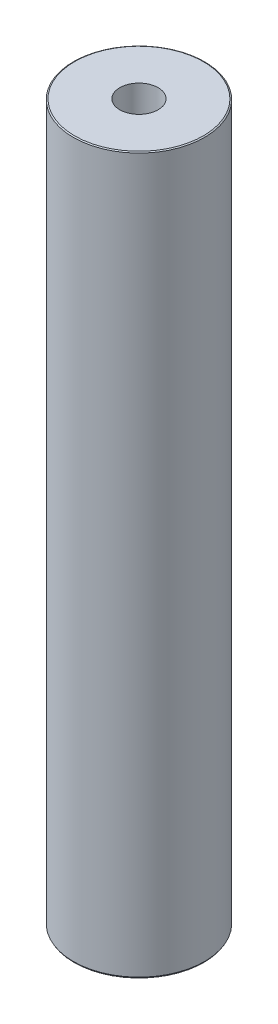
ISO-10303-21;
HEADER;
FILE_DESCRIPTION(('STEP AP214'),'2;1');
FILE_NAME('part.step','',(''),(''),'','','');
FILE_SCHEMA(('AUTOMOTIVE_DESIGN { 1 0 10303 214 1 1 1 1 }'));
ENDSEC;
DATA;
#1=APPLICATION_CONTEXT('core data for automotive mechanical design processes');
#2=APPLICATION_PROTOCOL_DEFINITION('international standard','automotive_design',2000,#1);
#3=PRODUCT_CONTEXT('',#1,'mechanical');
#4=PRODUCT('Part','Part','',(#3));
#5=PRODUCT_RELATED_PRODUCT_CATEGORY('part','',(#4));
#6=PRODUCT_DEFINITION_FORMATION('','',#4);
#7=PRODUCT_DEFINITION_CONTEXT('part definition',#1,'design');
#8=PRODUCT_DEFINITION('design','',#6,#7);
#9=PRODUCT_DEFINITION_SHAPE('','',#8);
#10=(LENGTH_UNIT() NAMED_UNIT(*) SI_UNIT(.MILLI.,.METRE.));
#11=(NAMED_UNIT(*) PLANE_ANGLE_UNIT() SI_UNIT($,.RADIAN.));
#12=(NAMED_UNIT(*) SI_UNIT($,.STERADIAN.) SOLID_ANGLE_UNIT());
#13=UNCERTAINTY_MEASURE_WITH_UNIT(LENGTH_MEASURE(1.E-05),#10,'distance_accuracy_value','');
#14=(GEOMETRIC_REPRESENTATION_CONTEXT(3) GLOBAL_UNCERTAINTY_ASSIGNED_CONTEXT((#13)) GLOBAL_UNIT_ASSIGNED_CONTEXT((#10,
#11,#12)) REPRESENTATION_CONTEXT('',''));
#15=CARTESIAN_POINT('',(0.,0.,0.));
#16=DIRECTION('',(0.,0.,1.));
#17=DIRECTION('',(1.,0.,0.));
#18=AXIS2_PLACEMENT_3D('',#15,#16,#17);
#19=CARTESIAN_POINT('',(0.,600.,0.));
#20=DIRECTION('',(0.,-1.,0.));
#21=DIRECTION('',(0.,0.,-1.));
#22=AXIS2_PLACEMENT_3D('',#19,#20,#21);
#23=CYLINDRICAL_SURFACE('',#22,55.);
#24=CARTESIAN_POINT('',(0.,599.39408746413,0.));
#25=DIRECTION('',(0.,1.,0.));
#26=DIRECTION('',(0.,0.,1.));
#27=AXIS2_PLACEMENT_3D('',#24,#25,#26);
#28=CIRCLE('',#27,55.);
#29=CARTESIAN_POINT('',(0.,599.39408746413,55.));
#30=VERTEX_POINT('',#29);
#31=EDGE_CURVE('E50',#30,#30,#28,.F.);
#32=ORIENTED_EDGE('',*,*,#31,.T.);
#33=EDGE_LOOP('',(#32));
#34=FACE_BOUND('',#33,.T.);
#35=CARTESIAN_POINT('',(0.,1.04947129707067,0.));
#36=DIRECTION('',(0.,1.,0.));
#37=DIRECTION('',(0.,0.,1.));
#38=AXIS2_PLACEMENT_3D('',#35,#36,#37);
#39=CIRCLE('',#38,55.);
#40=CARTESIAN_POINT('',(0.,1.04947129707067,55.));
#41=VERTEX_POINT('',#40);
#42=EDGE_CURVE('E51',#41,#41,#39,.T.);
#43=ORIENTED_EDGE('',*,*,#42,.T.);
#44=EDGE_LOOP('',(#43));
#45=FACE_BOUND('',#44,.T.);
#46=ADVANCED_FACE('F39',(#34,#45),#23,.T.);
#47=CARTESIAN_POINT('',(0.,600.,0.));
#48=DIRECTION('',(0.,1.,0.));
#49=DIRECTION('',(0.,0.,1.));
#50=AXIS2_PLACEMENT_3D('',#47,#48,#49);
#51=PLANE('',#50);
#52=CARTESIAN_POINT('',(0.,600.,0.));
#53=DIRECTION('',(0.,1.,0.));
#54=DIRECTION('',(0.,0.,1.));
#55=AXIS2_PLACEMENT_3D('',#52,#53,#54);
#56=CIRCLE('',#55,53.9505287029296);
#57=CARTESIAN_POINT('',(0.,600.,53.9505287029296));
#58=VERTEX_POINT('',#57);
#59=EDGE_CURVE('E54',#58,#58,#56,.T.);
#60=ORIENTED_EDGE('',*,*,#59,.T.);
#61=EDGE_LOOP('',(#60));
#62=FACE_BOUND('',#61,.T.);
#63=CARTESIAN_POINT('',(0.,600.,0.));
#64=DIRECTION('',(0.,1.,0.));
#65=DIRECTION('',(0.,0.,1.));
#66=AXIS2_PLACEMENT_3D('',#63,#64,#65);
#67=CIRCLE('',#66,16.0921565804989);
#68=CARTESIAN_POINT('',(0.,600.,16.0921565804989));
#69=VERTEX_POINT('',#68);
#70=EDGE_CURVE('E58',#69,#69,#67,.T.);
#71=ORIENTED_EDGE('',*,*,#70,.F.);
#72=EDGE_LOOP('',(#71));
#73=FACE_BOUND('',#72,.T.);
#74=ADVANCED_FACE('F69',(#62,#73),#51,.T.);
#75=CARTESIAN_POINT('',(0.,0.,0.));
#76=DIRECTION('',(0.,1.,0.));
#77=DIRECTION('',(0.,0.,1.));
#78=AXIS2_PLACEMENT_3D('',#75,#76,#77);
#79=PLANE('',#78);
#80=CARTESIAN_POINT('',(0.,0.,0.));
#81=DIRECTION('',(0.,1.,0.));
#82=DIRECTION('',(0.,0.,1.));
#83=AXIS2_PLACEMENT_3D('',#80,#81,#82);
#84=CIRCLE('',#83,54.3940874641294);
#85=CARTESIAN_POINT('',(0.,0.,54.3940874641294));
#86=VERTEX_POINT('',#85);
#87=EDGE_CURVE('E10',#86,#86,#84,.F.);
#88=ORIENTED_EDGE('',*,*,#87,.T.);
#89=EDGE_LOOP('',(#88));
#90=FACE_BOUND('',#89,.T.);
#91=CARTESIAN_POINT('',(0.,0.,0.));
#92=DIRECTION('',(0.,1.,0.));
#93=DIRECTION('',(0.,0.,1.));
#94=AXIS2_PLACEMENT_3D('',#91,#92,#93);
#95=CIRCLE('',#94,16.0921565804989);
#96=CARTESIAN_POINT('',(0.,0.,16.0921565804989));
#97=VERTEX_POINT('',#96);
#98=EDGE_CURVE('E63',#97,#97,#95,.T.);
#99=ORIENTED_EDGE('',*,*,#98,.T.);
#100=EDGE_LOOP('',(#99));
#101=FACE_BOUND('',#100,.T.);
#102=ADVANCED_FACE('F75',(#90,#101),#79,.F.);
#103=CARTESIAN_POINT('',(0.,600.,0.));
#104=DIRECTION('',(0.,-1.,0.));
#105=DIRECTION('',(0.,0.,-1.));
#106=AXIS2_PLACEMENT_3D('',#103,#104,#105);
#107=CYLINDRICAL_SURFACE('',#106,16.0921565804989);
#108=ORIENTED_EDGE('',*,*,#70,.T.);
#109=EDGE_LOOP('',(#108));
#110=FACE_BOUND('',#109,.T.);
#111=ORIENTED_EDGE('',*,*,#98,.F.);
#112=EDGE_LOOP('',(#111));
#113=FACE_BOUND('',#112,.T.);
#114=ADVANCED_FACE('F70',(#110,#113),#107,.F.);
#115=CARTESIAN_POINT('',(0.,600.,0.));
#116=DIRECTION('',(0.,-1.,0.));
#117=DIRECTION('',(0.,0.,-1.));
#118=AXIS2_PLACEMENT_3D('',#115,#116,#117);
#119=CONICAL_SURFACE('',#118,53.9505287029296,1.04719755119659);
#120=ORIENTED_EDGE('',*,*,#31,.F.);
#121=EDGE_LOOP('',(#120));
#122=FACE_BOUND('',#121,.T.);
#123=ORIENTED_EDGE('',*,*,#59,.F.);
#124=EDGE_LOOP('',(#123));
#125=FACE_BOUND('',#124,.T.);
#126=ADVANCED_FACE('F81',(#122,#125),#119,.T.);
#127=CARTESIAN_POINT('',(0.,1.04947129707067,0.));
#128=DIRECTION('',(0.,1.,0.));
#129=DIRECTION('',(0.,0.,1.));
#130=AXIS2_PLACEMENT_3D('',#127,#128,#129);
#131=CONICAL_SURFACE('',#130,55.,0.523598775598318);
#132=ORIENTED_EDGE('',*,*,#87,.F.);
#133=EDGE_LOOP('',(#132));
#134=FACE_BOUND('',#133,.T.);
#135=ORIENTED_EDGE('',*,*,#42,.F.);
#136=EDGE_LOOP('',(#135));
#137=FACE_BOUND('',#136,.T.);
#138=ADVANCED_FACE('F45',(#134,#137),#131,.T.);
#139=CLOSED_SHELL('',(#46,#74,#102,#114,#126,#138));
#140=MANIFOLD_SOLID_BREP('B2',#139);
#141=ADVANCED_BREP_SHAPE_REPRESENTATION('',(#18,#140),#14);
#142=SHAPE_DEFINITION_REPRESENTATION(#9,#141);
ENDSEC;
END-ISO-10303-21;
